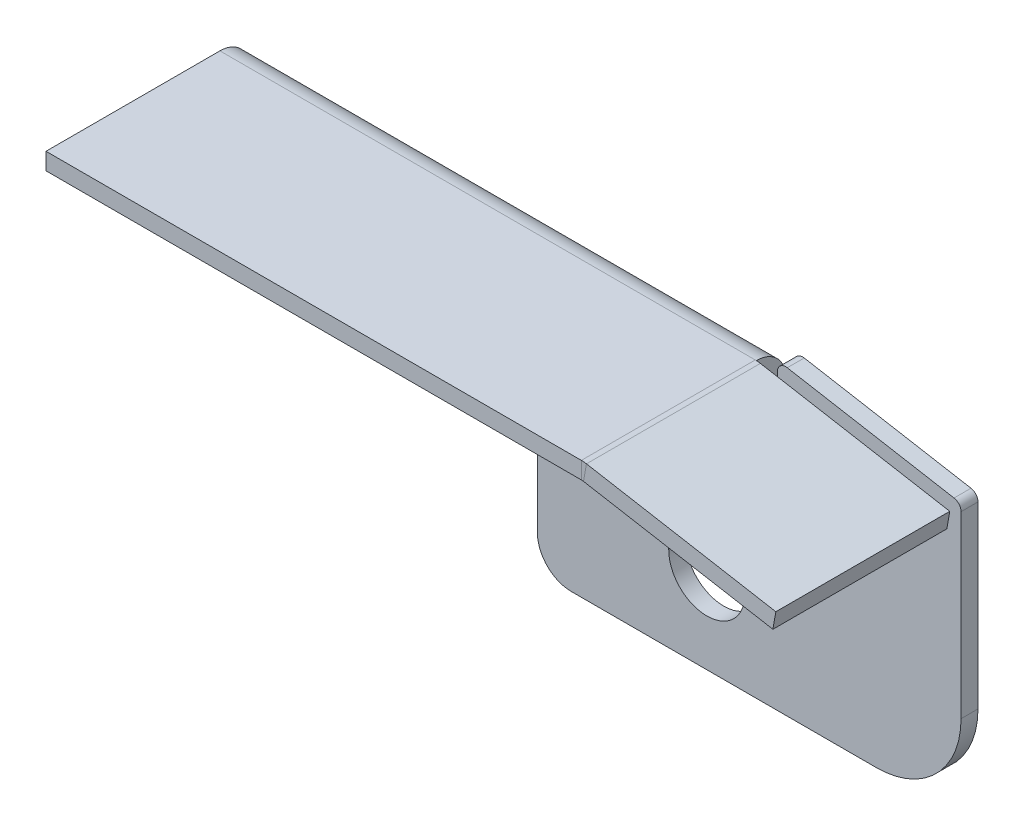
ISO-10303-21;
HEADER;
FILE_DESCRIPTION(('STEP AP214'),'2;1');
FILE_NAME('part.step','',(''),(''),'','','');
FILE_SCHEMA(('AUTOMOTIVE_DESIGN { 1 0 10303 214 1 1 1 1 }'));
ENDSEC;
DATA;
#1=APPLICATION_CONTEXT('core data for automotive mechanical design processes');
#2=APPLICATION_PROTOCOL_DEFINITION('international standard','automotive_design',2000,#1);
#3=PRODUCT_CONTEXT('',#1,'mechanical');
#4=PRODUCT('Part','Part','',(#3));
#5=PRODUCT_RELATED_PRODUCT_CATEGORY('part','',(#4));
#6=PRODUCT_DEFINITION_FORMATION('','',#4);
#7=PRODUCT_DEFINITION_CONTEXT('part definition',#1,'design');
#8=PRODUCT_DEFINITION('design','',#6,#7);
#9=PRODUCT_DEFINITION_SHAPE('','',#8);
#10=(LENGTH_UNIT() NAMED_UNIT(*) SI_UNIT(.MILLI.,.METRE.));
#11=(NAMED_UNIT(*) PLANE_ANGLE_UNIT() SI_UNIT($,.RADIAN.));
#12=(NAMED_UNIT(*) SI_UNIT($,.STERADIAN.) SOLID_ANGLE_UNIT());
#13=UNCERTAINTY_MEASURE_WITH_UNIT(LENGTH_MEASURE(1.E-05),#10,'distance_accuracy_value','');
#14=(GEOMETRIC_REPRESENTATION_CONTEXT(3) GLOBAL_UNCERTAINTY_ASSIGNED_CONTEXT((#13)) GLOBAL_UNIT_ASSIGNED_CONTEXT((#10,
#11,#12)) REPRESENTATION_CONTEXT('',''));
#15=CARTESIAN_POINT('',(0.,0.,0.));
#16=DIRECTION('',(0.,0.,1.));
#17=DIRECTION('',(1.,0.,0.));
#18=AXIS2_PLACEMENT_3D('',#15,#16,#17);
#19=CARTESIAN_POINT('',(0.,-0.50000000000001,0.));
#20=DIRECTION('',(0.,-1.,0.));
#21=DIRECTION('',(0.,0.,-1.));
#22=AXIS2_PLACEMENT_3D('',#19,#20,#21);
#23=PLANE('',#22);
#24=DIRECTION('',(0.,0.,1.));
#25=VECTOR('',#24,1.);
#26=CARTESIAN_POINT('',(-28.4070077887888,-0.499999999999933,12.));
#27=LINE('',#26,#25);
#28=CARTESIAN_POINT('',(-28.4070077887888,-0.499999999999933,12.));
#29=VERTEX_POINT('',#28);
#30=CARTESIAN_POINT('',(-28.4070077887888,-0.500000000000008,1.73659999999999));
#31=VERTEX_POINT('',#30);
#32=EDGE_CURVE('E260',#29,#31,#27,.F.);
#33=ORIENTED_EDGE('',*,*,#32,.T.);
#34=DIRECTION('',(-1.,0.,0.));
#35=VECTOR('',#34,1.);
#36=CARTESIAN_POINT('',(-28.3425636392357,-0.500000000000008,1.73659999999999));
#37=LINE('',#36,#35);
#38=CARTESIAN_POINT('',(-60.,-0.500000000000012,1.73659999999999));
#39=VERTEX_POINT('',#38);
#40=EDGE_CURVE('E398',#39,#31,#37,.F.);
#41=ORIENTED_EDGE('',*,*,#40,.F.);
#42=DIRECTION('',(0.,0.,1.));
#43=VECTOR('',#42,1.);
#44=CARTESIAN_POINT('',(-60.,-0.500000000000018,0.));
#45=LINE('',#44,#43);
#46=CARTESIAN_POINT('',(-60.,-0.499999999999976,12.));
#47=VERTEX_POINT('',#46);
#48=EDGE_CURVE('E688',#39,#47,#45,.T.);
#49=ORIENTED_EDGE('',*,*,#48,.T.);
#50=DIRECTION('',(1.,0.,0.));
#51=VECTOR('',#50,1.);
#52=CARTESIAN_POINT('',(0.,-0.499999999999969,12.));
#53=LINE('',#52,#51);
#54=EDGE_CURVE('E691',#47,#29,#53,.T.);
#55=ORIENTED_EDGE('',*,*,#54,.T.);
#56=EDGE_LOOP('',(#33,#41,#49,#55));
#57=FACE_BOUND('',#56,.T.);
#58=ADVANCED_FACE('F63',(#57),#23,.F.);
#59=CARTESIAN_POINT('',(0.,-1.50000000000001,0.));
#60=DIRECTION('',(0.,-1.,0.));
#61=DIRECTION('',(0.,0.,-1.));
#62=AXIS2_PLACEMENT_3D('',#59,#60,#61);
#63=PLANE('',#62);
#64=DIRECTION('',(-1.,0.,0.));
#65=VECTOR('',#64,1.);
#66=CARTESIAN_POINT('',(-28.3425636392357,-1.50000000000001,1.7366));
#67=LINE('',#66,#65);
#68=CARTESIAN_POINT('',(-28.4070077887888,-1.50000000000001,1.7366));
#69=VERTEX_POINT('',#68);
#70=CARTESIAN_POINT('',(-60.,-1.50000000000001,1.7366));
#71=VERTEX_POINT('',#70);
#72=EDGE_CURVE('E395',#69,#71,#67,.T.);
#73=ORIENTED_EDGE('',*,*,#72,.F.);
#74=DIRECTION('',(0.,0.,1.));
#75=VECTOR('',#74,1.);
#76=CARTESIAN_POINT('',(-28.4070077887888,-1.49999999999993,12.));
#77=LINE('',#76,#75);
#78=CARTESIAN_POINT('',(-28.4070077887888,-1.49999999999993,12.));
#79=VERTEX_POINT('',#78);
#80=EDGE_CURVE('E317',#79,#69,#77,.F.);
#81=ORIENTED_EDGE('',*,*,#80,.F.);
#82=DIRECTION('',(-1.,0.,0.));
#83=VECTOR('',#82,1.);
#84=CARTESIAN_POINT('',(-28.3425636392357,-1.49999999999997,12.));
#85=LINE('',#84,#83);
#86=CARTESIAN_POINT('',(-60.,-1.49999999999998,12.));
#87=VERTEX_POINT('',#86);
#88=EDGE_CURVE('E684',#87,#79,#85,.F.);
#89=ORIENTED_EDGE('',*,*,#88,.F.);
#90=DIRECTION('',(0.,0.,-1.));
#91=VECTOR('',#90,1.);
#92=CARTESIAN_POINT('',(-60.,-1.49999999999998,12.));
#93=LINE('',#92,#91);
#94=EDGE_CURVE('E402',#71,#87,#93,.F.);
#95=ORIENTED_EDGE('',*,*,#94,.F.);
#96=EDGE_LOOP('',(#73,#81,#89,#95));
#97=FACE_BOUND('',#96,.T.);
#98=ADVANCED_FACE('F352',(#97),#63,.T.);
#99=CARTESIAN_POINT('',(-28.3425636392357,-0.499999999999972,12.));
#100=DIRECTION('',(0.,0.,-1.));
#101=DIRECTION('',(0.,1.,0.));
#102=AXIS2_PLACEMENT_3D('',#99,#100,#101);
#103=PLANE('',#102);
#104=DIRECTION('',(0.,1.,0.));
#105=VECTOR('',#104,1.);
#106=CARTESIAN_POINT('',(-28.4070077887888,-1.49999999999993,12.));
#107=LINE('',#106,#105);
#108=EDGE_CURVE('E323',#79,#29,#107,.T.);
#109=ORIENTED_EDGE('',*,*,#108,.T.);
#110=ORIENTED_EDGE('',*,*,#54,.F.);
#111=DIRECTION('',(0.,-1.,0.));
#112=VECTOR('',#111,1.);
#113=CARTESIAN_POINT('',(-60.,-0.499999999999976,12.));
#114=LINE('',#113,#112);
#115=EDGE_CURVE('E663',#47,#87,#114,.T.);
#116=ORIENTED_EDGE('',*,*,#115,.T.);
#117=ORIENTED_EDGE('',*,*,#88,.T.);
#118=EDGE_LOOP('',(#109,#110,#116,#117));
#119=FACE_BOUND('',#118,.T.);
#120=ADVANCED_FACE('F356',(#119),#103,.F.);
#121=CARTESIAN_POINT('',(-22.,-13.5,1.));
#122=DIRECTION('',(0.,0.,-1.));
#123=DIRECTION('',(-1.,0.,0.));
#124=AXIS2_PLACEMENT_3D('',#121,#122,#123);
#125=PLANE('',#124);
#126=CARTESIAN_POINT('',(-32.,-7.50000000000001,1.));
#127=DIRECTION('',(0.,0.,1.));
#128=DIRECTION('',(1.,0.,0.));
#129=AXIS2_PLACEMENT_3D('',#126,#127,#128);
#130=CIRCLE('',#129,2.24999999999999);
#131=CARTESIAN_POINT('',(-29.75,-7.50000000000001,1.));
#132=VERTEX_POINT('',#131);
#133=CARTESIAN_POINT('',(-34.25,-7.50000000000001,1.));
#134=VERTEX_POINT('',#133);
#135=EDGE_CURVE('E534',#132,#134,#130,.T.);
#136=ORIENTED_EDGE('',*,*,#135,.F.);
#137=DIRECTION('',(0.,1.,0.));
#138=VECTOR('',#137,1.);
#139=CARTESIAN_POINT('',(-29.75,-7.50000000000001,1.));
#140=LINE('',#139,#138);
#141=CARTESIAN_POINT('',(-29.75,-13.5,1.));
#142=VERTEX_POINT('',#141);
#143=EDGE_CURVE('E545',#142,#132,#140,.T.);
#144=ORIENTED_EDGE('',*,*,#143,.F.);
#145=CARTESIAN_POINT('',(-32.,-13.5,1.));
#146=DIRECTION('',(0.,0.,1.));
#147=DIRECTION('',(1.,0.,0.));
#148=AXIS2_PLACEMENT_3D('',#145,#146,#147);
#149=CIRCLE('',#148,2.25);
#150=CARTESIAN_POINT('',(-34.25,-13.5,1.));
#151=VERTEX_POINT('',#150);
#152=EDGE_CURVE('E541',#151,#142,#149,.T.);
#153=ORIENTED_EDGE('',*,*,#152,.F.);
#154=DIRECTION('',(0.,-1.,0.));
#155=VECTOR('',#154,1.);
#156=CARTESIAN_POINT('',(-34.25,-7.50000000000001,1.));
#157=LINE('',#156,#155);
#158=EDGE_CURVE('E537',#134,#151,#157,.T.);
#159=ORIENTED_EDGE('',*,*,#158,.F.);
#160=EDGE_LOOP('',(#136,#144,#153,#159));
#161=FACE_BOUND('',#160,.T.);
#162=DIRECTION('',(0.,1.,0.));
#163=VECTOR('',#162,1.);
#164=CARTESIAN_POINT('',(-17.,-13.5,1.));
#165=LINE('',#164,#163);
#166=CARTESIAN_POINT('',(-17.,-13.5,1.));
#167=VERTEX_POINT('',#166);
#168=CARTESIAN_POINT('',(-17.,-2.91954981558865,1.));
#169=VERTEX_POINT('',#168);
#170=EDGE_CURVE('E438',#167,#169,#165,.T.);
#171=ORIENTED_EDGE('',*,*,#170,.T.);
#172=CARTESIAN_POINT('',(-17.5,-2.91954981558865,1.));
#173=DIRECTION('',(0.,0.,-1.));
#174=DIRECTION('',(-1.,0.,0.));
#175=AXIS2_PLACEMENT_3D('',#172,#173,#174);
#176=CIRCLE('',#175,0.5);
#177=CARTESIAN_POINT('',(-17.4131759111665,-2.42714593908255,1.));
#178=VERTEX_POINT('',#177);
#179=EDGE_CURVE('E72',#169,#178,#176,.F.);
#180=ORIENTED_EDGE('',*,*,#179,.T.);
#181=DIRECTION('',(-0.984807753012209,0.173648177666926,0.));
#182=VECTOR('',#181,1.);
#183=CARTESIAN_POINT('',(-17.,-2.50000000000001,1.));
#184=LINE('',#183,#182);
#185=CARTESIAN_POINT('',(-27.2557395504022,-0.69163641014524,1.));
#186=VERTEX_POINT('',#185);
#187=EDGE_CURVE('E437',#178,#186,#184,.T.);
#188=ORIENTED_EDGE('',*,*,#187,.T.);
#189=CARTESIAN_POINT('',(-27.3425636392356,-1.18404028665135,1.));
#190=DIRECTION('',(0.,0.,-1.));
#191=DIRECTION('',(-1.,0.,0.));
#192=AXIS2_PLACEMENT_3D('',#189,#190,#191);
#193=CIRCLE('',#192,0.5);
#194=CARTESIAN_POINT('',(-27.8425636392356,-1.18404028665135,0.999999999999999));
#195=VERTEX_POINT('',#194);
#196=EDGE_CURVE('E79',#186,#195,#193,.F.);
#197=ORIENTED_EDGE('',*,*,#196,.T.);
#198=DIRECTION('',(0.,1.,0.));
#199=VECTOR('',#198,1.);
#200=CARTESIAN_POINT('',(-27.8425636392356,-2.73660000000001,0.999999999999998));
#201=LINE('',#200,#199);
#202=CARTESIAN_POINT('',(-27.8425636392356,-2.73660000000001,1.));
#203=VERTEX_POINT('',#202);
#204=EDGE_CURVE('E522',#203,#195,#201,.T.);
#205=ORIENTED_EDGE('',*,*,#204,.F.);
#206=DIRECTION('',(1.,0.,0.));
#207=VECTOR('',#206,1.);
#208=CARTESIAN_POINT('',(-28.3425636392357,-2.73660000000001,0.999999999999998));
#209=LINE('',#208,#207);
#210=CARTESIAN_POINT('',(-28.3425636392357,-2.73660000000001,1.));
#211=VERTEX_POINT('',#210);
#212=EDGE_CURVE('E521',#211,#203,#209,.T.);
#213=ORIENTED_EDGE('',*,*,#212,.F.);
#214=DIRECTION('',(0.,-1.,0.));
#215=VECTOR('',#214,1.);
#216=CARTESIAN_POINT('',(-28.3425636392357,-2.23660000000001,0.999999999999998));
#217=LINE('',#216,#215);
#218=CARTESIAN_POINT('',(-28.3425636392357,-2.23660000000001,0.999999999999998));
#219=VERTEX_POINT('',#218);
#220=EDGE_CURVE('E519',#219,#211,#217,.T.);
#221=ORIENTED_EDGE('',*,*,#220,.F.);
#222=DIRECTION('',(-1.,0.,0.));
#223=VECTOR('',#222,1.);
#224=CARTESIAN_POINT('',(-60.,-2.23660000000001,0.999999999999998));
#225=LINE('',#224,#223);
#226=CARTESIAN_POINT('',(-60.,-2.23660000000001,0.999999999999998));
#227=VERTEX_POINT('',#226);
#228=EDGE_CURVE('E662',#227,#219,#225,.F.);
#229=ORIENTED_EDGE('',*,*,#228,.F.);
#230=DIRECTION('',(0.,-1.,0.));
#231=VECTOR('',#230,1.);
#232=CARTESIAN_POINT('',(-60.,-6.5,1.));
#233=LINE('',#232,#231);
#234=CARTESIAN_POINT('',(-60.,-6.50000000000001,1.));
#235=VERTEX_POINT('',#234);
#236=EDGE_CURVE('E464',#227,#235,#233,.T.);
#237=ORIENTED_EDGE('',*,*,#236,.T.);
#238=CARTESIAN_POINT('',(-58.,-6.50000000000001,1.));
#239=DIRECTION('',(0.,0.,1.));
#240=DIRECTION('',(-1.,0.,0.));
#241=AXIS2_PLACEMENT_3D('',#238,#239,#240);
#242=CIRCLE('',#241,2.);
#243=CARTESIAN_POINT('',(-58.,-8.50000000000001,1.));
#244=VERTEX_POINT('',#243);
#245=EDGE_CURVE('E579',#235,#244,#242,.T.);
#246=ORIENTED_EDGE('',*,*,#245,.T.);
#247=DIRECTION('',(1.,0.,0.));
#248=VECTOR('',#247,1.);
#249=CARTESIAN_POINT('',(-42.,-8.50000000000001,1.));
#250=LINE('',#249,#248);
#251=CARTESIAN_POINT('',(-42.,-8.50000000000001,1.));
#252=VERTEX_POINT('',#251);
#253=EDGE_CURVE('E582',#244,#252,#250,.T.);
#254=ORIENTED_EDGE('',*,*,#253,.T.);
#255=DIRECTION('',(0.,-1.,0.));
#256=VECTOR('',#255,1.);
#257=CARTESIAN_POINT('',(-42.,-8.50000000000001,1.));
#258=LINE('',#257,#256);
#259=CARTESIAN_POINT('',(-42.,-16.5,1.));
#260=VERTEX_POINT('',#259);
#261=EDGE_CURVE('E585',#252,#260,#258,.T.);
#262=ORIENTED_EDGE('',*,*,#261,.T.);
#263=CARTESIAN_POINT('',(-40.,-16.5,1.));
#264=DIRECTION('',(0.,0.,1.));
#265=DIRECTION('',(1.,0.,0.));
#266=AXIS2_PLACEMENT_3D('',#263,#264,#265);
#267=CIRCLE('',#266,2.);
#268=CARTESIAN_POINT('',(-40.,-18.5,1.));
#269=VERTEX_POINT('',#268);
#270=EDGE_CURVE('E588',#260,#269,#267,.T.);
#271=ORIENTED_EDGE('',*,*,#270,.T.);
#272=DIRECTION('',(1.,0.,0.));
#273=VECTOR('',#272,1.);
#274=CARTESIAN_POINT('',(-40.,-18.5,1.));
#275=LINE('',#274,#273);
#276=CARTESIAN_POINT('',(-22.,-18.5,1.));
#277=VERTEX_POINT('',#276);
#278=EDGE_CURVE('E591',#269,#277,#275,.T.);
#279=ORIENTED_EDGE('',*,*,#278,.T.);
#280=CARTESIAN_POINT('',(-22.,-13.5,1.));
#281=DIRECTION('',(0.,0.,1.));
#282=DIRECTION('',(-1.,0.,0.));
#283=AXIS2_PLACEMENT_3D('',#280,#281,#282);
#284=CIRCLE('',#283,5.);
#285=EDGE_CURVE('E594',#277,#167,#284,.T.);
#286=ORIENTED_EDGE('',*,*,#285,.T.);
#287=EDGE_LOOP('',(#171,#180,#188,#197,#205,#213,#221,#229,#237,#246,#254,#262,#271,#279,#286));
#288=FACE_BOUND('',#287,.T.);
#289=ADVANCED_FACE('F360',(#161,#288),#125,.F.);
#290=CARTESIAN_POINT('',(-22.,-13.5,0.));
#291=DIRECTION('',(0.,0.,-1.));
#292=DIRECTION('',(-1.,0.,0.));
#293=AXIS2_PLACEMENT_3D('',#290,#291,#292);
#294=PLANE('',#293);
#295=DIRECTION('',(0.,1.,0.));
#296=VECTOR('',#295,1.);
#297=CARTESIAN_POINT('',(-29.75,-7.50000000000001,0.));
#298=LINE('',#297,#296);
#299=CARTESIAN_POINT('',(-29.75,-13.5,0.));
#300=VERTEX_POINT('',#299);
#301=CARTESIAN_POINT('',(-29.75,-7.50000000000001,0.));
#302=VERTEX_POINT('',#301);
#303=EDGE_CURVE('E538',#300,#302,#298,.T.);
#304=ORIENTED_EDGE('',*,*,#303,.T.);
#305=CARTESIAN_POINT('',(-32.,-7.50000000000001,0.));
#306=DIRECTION('',(0.,0.,1.));
#307=DIRECTION('',(1.,0.,0.));
#308=AXIS2_PLACEMENT_3D('',#305,#306,#307);
#309=CIRCLE('',#308,2.24999999999999);
#310=CARTESIAN_POINT('',(-34.25,-7.50000000000001,0.));
#311=VERTEX_POINT('',#310);
#312=EDGE_CURVE('E533',#302,#311,#309,.T.);
#313=ORIENTED_EDGE('',*,*,#312,.T.);
#314=DIRECTION('',(0.,-1.,0.));
#315=VECTOR('',#314,1.);
#316=CARTESIAN_POINT('',(-34.25,-7.50000000000001,0.));
#317=LINE('',#316,#315);
#318=CARTESIAN_POINT('',(-34.25,-13.5,0.));
#319=VERTEX_POINT('',#318);
#320=EDGE_CURVE('E552',#311,#319,#317,.T.);
#321=ORIENTED_EDGE('',*,*,#320,.T.);
#322=CARTESIAN_POINT('',(-32.,-13.5,0.));
#323=DIRECTION('',(0.,0.,1.));
#324=DIRECTION('',(1.,0.,0.));
#325=AXIS2_PLACEMENT_3D('',#322,#323,#324);
#326=CIRCLE('',#325,2.25);
#327=EDGE_CURVE('E556',#319,#300,#326,.T.);
#328=ORIENTED_EDGE('',*,*,#327,.T.);
#329=EDGE_LOOP('',(#304,#313,#321,#328));
#330=FACE_BOUND('',#329,.T.);
#331=DIRECTION('',(-0.984807753012209,0.173648177666926,0.));
#332=VECTOR('',#331,1.);
#333=CARTESIAN_POINT('',(-17.,-2.50000000000001,0.));
#334=LINE('',#333,#332);
#335=CARTESIAN_POINT('',(-17.4131759111665,-2.42714593908255,0.));
#336=VERTEX_POINT('',#335);
#337=CARTESIAN_POINT('',(-27.2557395504022,-0.69163641014524,0.));
#338=VERTEX_POINT('',#337);
#339=EDGE_CURVE('E455',#336,#338,#334,.T.);
#340=ORIENTED_EDGE('',*,*,#339,.F.);
#341=CARTESIAN_POINT('',(-17.5,-2.91954981558865,0.));
#342=DIRECTION('',(0.,0.,-1.));
#343=DIRECTION('',(-1.,0.,0.));
#344=AXIS2_PLACEMENT_3D('',#341,#342,#343);
#345=CIRCLE('',#344,0.5);
#346=CARTESIAN_POINT('',(-17.,-2.91954981558865,0.));
#347=VERTEX_POINT('',#346);
#348=EDGE_CURVE('E428',#336,#347,#345,.T.);
#349=ORIENTED_EDGE('',*,*,#348,.T.);
#350=DIRECTION('',(0.,1.,0.));
#351=VECTOR('',#350,1.);
#352=CARTESIAN_POINT('',(-17.,-13.5,0.));
#353=LINE('',#352,#351);
#354=CARTESIAN_POINT('',(-17.,-13.5,0.));
#355=VERTEX_POINT('',#354);
#356=EDGE_CURVE('E454',#355,#347,#353,.T.);
#357=ORIENTED_EDGE('',*,*,#356,.F.);
#358=CARTESIAN_POINT('',(-22.,-13.5,0.));
#359=DIRECTION('',(0.,0.,1.));
#360=DIRECTION('',(-1.,0.,0.));
#361=AXIS2_PLACEMENT_3D('',#358,#359,#360);
#362=CIRCLE('',#361,5.);
#363=CARTESIAN_POINT('',(-22.,-18.5,0.));
#364=VERTEX_POINT('',#363);
#365=EDGE_CURVE('E460',#364,#355,#362,.T.);
#366=ORIENTED_EDGE('',*,*,#365,.F.);
#367=DIRECTION('',(1.,0.,0.));
#368=VECTOR('',#367,1.);
#369=CARTESIAN_POINT('',(-40.,-18.5,0.));
#370=LINE('',#369,#368);
#371=CARTESIAN_POINT('',(-40.,-18.5,0.));
#372=VERTEX_POINT('',#371);
#373=EDGE_CURVE('E466',#372,#364,#370,.T.);
#374=ORIENTED_EDGE('',*,*,#373,.F.);
#375=CARTESIAN_POINT('',(-40.,-16.5,0.));
#376=DIRECTION('',(0.,0.,1.));
#377=DIRECTION('',(1.,0.,0.));
#378=AXIS2_PLACEMENT_3D('',#375,#376,#377);
#379=CIRCLE('',#378,2.);
#380=CARTESIAN_POINT('',(-42.,-16.5,0.));
#381=VERTEX_POINT('',#380);
#382=EDGE_CURVE('E610',#381,#372,#379,.T.);
#383=ORIENTED_EDGE('',*,*,#382,.F.);
#384=DIRECTION('',(0.,-1.,0.));
#385=VECTOR('',#384,1.);
#386=CARTESIAN_POINT('',(-42.,-8.50000000000001,0.));
#387=LINE('',#386,#385);
#388=CARTESIAN_POINT('',(-42.,-8.50000000000001,0.));
#389=VERTEX_POINT('',#388);
#390=EDGE_CURVE('E607',#389,#381,#387,.T.);
#391=ORIENTED_EDGE('',*,*,#390,.F.);
#392=DIRECTION('',(1.,0.,0.));
#393=VECTOR('',#392,1.);
#394=CARTESIAN_POINT('',(-42.,-8.50000000000001,0.));
#395=LINE('',#394,#393);
#396=CARTESIAN_POINT('',(-58.,-8.50000000000001,0.));
#397=VERTEX_POINT('',#396);
#398=EDGE_CURVE('E604',#397,#389,#395,.T.);
#399=ORIENTED_EDGE('',*,*,#398,.F.);
#400=CARTESIAN_POINT('',(-58.,-6.50000000000001,0.));
#401=DIRECTION('',(0.,0.,1.));
#402=DIRECTION('',(-1.,0.,0.));
#403=AXIS2_PLACEMENT_3D('',#400,#401,#402);
#404=CIRCLE('',#403,2.);
#405=CARTESIAN_POINT('',(-60.,-6.50000000000001,0.));
#406=VERTEX_POINT('',#405);
#407=EDGE_CURVE('E601',#406,#397,#404,.T.);
#408=ORIENTED_EDGE('',*,*,#407,.F.);
#409=DIRECTION('',(0.,-1.,0.));
#410=VECTOR('',#409,1.);
#411=CARTESIAN_POINT('',(-60.,-6.5,0.));
#412=LINE('',#411,#410);
#413=CARTESIAN_POINT('',(-60.,-2.23660000000001,0.));
#414=VERTEX_POINT('',#413);
#415=EDGE_CURVE('E576',#414,#406,#412,.T.);
#416=ORIENTED_EDGE('',*,*,#415,.F.);
#417=DIRECTION('',(-1.,0.,0.));
#418=VECTOR('',#417,1.);
#419=CARTESIAN_POINT('',(-60.,-2.23660000000001,0.));
#420=LINE('',#419,#418);
#421=CARTESIAN_POINT('',(-28.3425636392357,-2.2366,0.));
#422=VERTEX_POINT('',#421);
#423=EDGE_CURVE('E390',#414,#422,#420,.F.);
#424=ORIENTED_EDGE('',*,*,#423,.T.);
#425=DIRECTION('',(0.,-1.,0.));
#426=VECTOR('',#425,1.);
#427=CARTESIAN_POINT('',(-28.3425636392357,-13.5,0.));
#428=LINE('',#427,#426);
#429=CARTESIAN_POINT('',(-28.3425636392357,-2.7366,0.));
#430=VERTEX_POINT('',#429);
#431=EDGE_CURVE('E421',#422,#430,#428,.T.);
#432=ORIENTED_EDGE('',*,*,#431,.T.);
#433=DIRECTION('',(1.,0.,0.));
#434=VECTOR('',#433,1.);
#435=CARTESIAN_POINT('',(-22.,-2.7366,0.));
#436=LINE('',#435,#434);
#437=CARTESIAN_POINT('',(-27.8425636392356,-2.73660000000001,0.));
#438=VERTEX_POINT('',#437);
#439=EDGE_CURVE('E496',#430,#438,#436,.T.);
#440=ORIENTED_EDGE('',*,*,#439,.T.);
#441=DIRECTION('',(0.,1.,0.));
#442=VECTOR('',#441,1.);
#443=CARTESIAN_POINT('',(-27.8425636392356,-13.5,0.));
#444=LINE('',#443,#442);
#445=CARTESIAN_POINT('',(-27.8425636392356,-1.18404028665135,0.));
#446=VERTEX_POINT('',#445);
#447=EDGE_CURVE('E530',#438,#446,#444,.T.);
#448=ORIENTED_EDGE('',*,*,#447,.T.);
#449=CARTESIAN_POINT('',(-27.3425636392356,-1.18404028665135,0.));
#450=DIRECTION('',(0.,0.,-1.));
#451=DIRECTION('',(-1.,0.,0.));
#452=AXIS2_PLACEMENT_3D('',#449,#450,#451);
#453=CIRCLE('',#452,0.5);
#454=EDGE_CURVE('E425',#446,#338,#453,.T.);
#455=ORIENTED_EDGE('',*,*,#454,.T.);
#456=EDGE_LOOP('',(#340,#349,#357,#366,#374,#383,#391,#399,#408,#416,#424,#432,#440,#448,#455));
#457=FACE_BOUND('',#456,.T.);
#458=ADVANCED_FACE('F452',(#330,#457),#294,.T.);
#459=CARTESIAN_POINT('',(-60.,-6.5,1.));
#460=DIRECTION('',(1.,0.,0.));
#461=DIRECTION('',(0.,1.,0.));
#462=AXIS2_PLACEMENT_3D('',#459,#460,#461);
#463=PLANE('',#462);
#464=DIRECTION('',(0.,0.,-1.));
#465=VECTOR('',#464,1.);
#466=CARTESIAN_POINT('',(-60.,-2.23660000000001,0.999999999999998));
#467=LINE('',#466,#465);
#468=EDGE_CURVE('E389',#227,#414,#467,.T.);
#469=ORIENTED_EDGE('',*,*,#468,.T.);
#470=ORIENTED_EDGE('',*,*,#415,.T.);
#471=DIRECTION('',(0.,0.,-1.));
#472=VECTOR('',#471,1.);
#473=CARTESIAN_POINT('',(-60.,-6.50000000000001,1.));
#474=LINE('',#473,#472);
#475=EDGE_CURVE('E492',#235,#406,#474,.T.);
#476=ORIENTED_EDGE('',*,*,#475,.F.);
#477=ORIENTED_EDGE('',*,*,#236,.F.);
#478=EDGE_LOOP('',(#469,#470,#476,#477));
#479=FACE_BOUND('',#478,.T.);
#480=ADVANCED_FACE('F644',(#479),#463,.F.);
#481=CARTESIAN_POINT('',(-17.,-2.50000000000001,1.));
#482=DIRECTION('',(-0.173648177666926,-0.984807753012209,0.));
#483=DIRECTION('',(0.984807753012209,-0.173648177666926,0.));
#484=AXIS2_PLACEMENT_3D('',#481,#482,#483);
#485=PLANE('',#484);
#486=ORIENTED_EDGE('',*,*,#187,.F.);
#487=DIRECTION('',(0.,0.,-1.));
#488=VECTOR('',#487,1.);
#489=CARTESIAN_POINT('',(-17.4131759111665,-2.42714593908255,1.));
#490=LINE('',#489,#488);
#491=EDGE_CURVE('E420',#178,#336,#490,.T.);
#492=ORIENTED_EDGE('',*,*,#491,.T.);
#493=ORIENTED_EDGE('',*,*,#339,.T.);
#494=DIRECTION('',(0.,0.,-1.));
#495=VECTOR('',#494,1.);
#496=CARTESIAN_POINT('',(-27.2557395504022,-0.69163641014524,1.));
#497=LINE('',#496,#495);
#498=EDGE_CURVE('E417',#338,#186,#497,.F.);
#499=ORIENTED_EDGE('',*,*,#498,.T.);
#500=EDGE_LOOP('',(#486,#492,#493,#499));
#501=FACE_BOUND('',#500,.T.);
#502=ADVANCED_FACE('F442',(#501),#485,.F.);
#503=CARTESIAN_POINT('',(-58.,-6.50000000000001,1.));
#504=DIRECTION('',(0.,0.,-1.));
#505=DIRECTION('',(-1.,0.,0.));
#506=AXIS2_PLACEMENT_3D('',#503,#504,#505);
#507=CYLINDRICAL_SURFACE('',#506,2.);
#508=ORIENTED_EDGE('',*,*,#407,.T.);
#509=DIRECTION('',(0.,0.,-1.));
#510=VECTOR('',#509,1.);
#511=CARTESIAN_POINT('',(-58.,-8.50000000000001,1.));
#512=LINE('',#511,#510);
#513=EDGE_CURVE('E488',#244,#397,#512,.T.);
#514=ORIENTED_EDGE('',*,*,#513,.F.);
#515=ORIENTED_EDGE('',*,*,#245,.F.);
#516=ORIENTED_EDGE('',*,*,#475,.T.);
#517=EDGE_LOOP('',(#508,#514,#515,#516));
#518=FACE_BOUND('',#517,.T.);
#519=ADVANCED_FACE('F640',(#518),#507,.T.);
#520=CARTESIAN_POINT('',(-42.,-8.50000000000001,1.));
#521=DIRECTION('',(0.,1.,0.));
#522=DIRECTION('',(-1.,0.,0.));
#523=AXIS2_PLACEMENT_3D('',#520,#521,#522);
#524=PLANE('',#523);
#525=ORIENTED_EDGE('',*,*,#398,.T.);
#526=DIRECTION('',(0.,0.,-1.));
#527=VECTOR('',#526,1.);
#528=CARTESIAN_POINT('',(-42.,-8.50000000000001,1.));
#529=LINE('',#528,#527);
#530=EDGE_CURVE('E484',#252,#389,#529,.T.);
#531=ORIENTED_EDGE('',*,*,#530,.F.);
#532=ORIENTED_EDGE('',*,*,#253,.F.);
#533=ORIENTED_EDGE('',*,*,#513,.T.);
#534=EDGE_LOOP('',(#525,#531,#532,#533));
#535=FACE_BOUND('',#534,.T.);
#536=ADVANCED_FACE('F636',(#535),#524,.F.);
#537=CARTESIAN_POINT('',(-42.,-8.50000000000001,1.));
#538=DIRECTION('',(1.,0.,0.));
#539=DIRECTION('',(0.,0.,-1.));
#540=AXIS2_PLACEMENT_3D('',#537,#538,#539);
#541=PLANE('',#540);
#542=ORIENTED_EDGE('',*,*,#390,.T.);
#543=DIRECTION('',(0.,0.,-1.));
#544=VECTOR('',#543,1.);
#545=CARTESIAN_POINT('',(-42.,-16.5,1.));
#546=LINE('',#545,#544);
#547=EDGE_CURVE('E480',#260,#381,#546,.T.);
#548=ORIENTED_EDGE('',*,*,#547,.F.);
#549=ORIENTED_EDGE('',*,*,#261,.F.);
#550=ORIENTED_EDGE('',*,*,#530,.T.);
#551=EDGE_LOOP('',(#542,#548,#549,#550));
#552=FACE_BOUND('',#551,.T.);
#553=ADVANCED_FACE('F632',(#552),#541,.F.);
#554=CARTESIAN_POINT('',(-40.,-16.5,1.));
#555=DIRECTION('',(0.,0.,-1.));
#556=DIRECTION('',(-1.,0.,0.));
#557=AXIS2_PLACEMENT_3D('',#554,#555,#556);
#558=CYLINDRICAL_SURFACE('',#557,2.);
#559=ORIENTED_EDGE('',*,*,#382,.T.);
#560=DIRECTION('',(0.,0.,-1.));
#561=VECTOR('',#560,1.);
#562=CARTESIAN_POINT('',(-40.,-18.5,1.));
#563=LINE('',#562,#561);
#564=EDGE_CURVE('E476',#269,#372,#563,.T.);
#565=ORIENTED_EDGE('',*,*,#564,.F.);
#566=ORIENTED_EDGE('',*,*,#270,.F.);
#567=ORIENTED_EDGE('',*,*,#547,.T.);
#568=EDGE_LOOP('',(#559,#565,#566,#567));
#569=FACE_BOUND('',#568,.T.);
#570=ADVANCED_FACE('F627',(#569),#558,.T.);
#571=CARTESIAN_POINT('',(-40.,-18.5,1.));
#572=DIRECTION('',(0.,1.,0.));
#573=DIRECTION('',(0.,0.,1.));
#574=AXIS2_PLACEMENT_3D('',#571,#572,#573);
#575=PLANE('',#574);
#576=ORIENTED_EDGE('',*,*,#373,.T.);
#577=DIRECTION('',(0.,0.,-1.));
#578=VECTOR('',#577,1.);
#579=CARTESIAN_POINT('',(-22.,-18.5,1.));
#580=LINE('',#579,#578);
#581=EDGE_CURVE('E472',#277,#364,#580,.T.);
#582=ORIENTED_EDGE('',*,*,#581,.F.);
#583=ORIENTED_EDGE('',*,*,#278,.F.);
#584=ORIENTED_EDGE('',*,*,#564,.T.);
#585=EDGE_LOOP('',(#576,#582,#583,#584));
#586=FACE_BOUND('',#585,.T.);
#587=ADVANCED_FACE('F616',(#586),#575,.F.);
#588=CARTESIAN_POINT('',(-22.,-13.5,1.));
#589=DIRECTION('',(0.,0.,-1.));
#590=DIRECTION('',(-1.,0.,0.));
#591=AXIS2_PLACEMENT_3D('',#588,#589,#590);
#592=CYLINDRICAL_SURFACE('',#591,5.);
#593=ORIENTED_EDGE('',*,*,#365,.T.);
#594=DIRECTION('',(0.,0.,-1.));
#595=VECTOR('',#594,1.);
#596=CARTESIAN_POINT('',(-17.,-13.5,1.));
#597=LINE('',#596,#595);
#598=EDGE_CURVE('E447',#167,#355,#597,.T.);
#599=ORIENTED_EDGE('',*,*,#598,.F.);
#600=ORIENTED_EDGE('',*,*,#285,.F.);
#601=ORIENTED_EDGE('',*,*,#581,.T.);
#602=EDGE_LOOP('',(#593,#599,#600,#601));
#603=FACE_BOUND('',#602,.T.);
#604=ADVANCED_FACE('F622',(#603),#592,.T.);
#605=CARTESIAN_POINT('',(-17.,-13.5,1.));
#606=DIRECTION('',(-1.,0.,0.));
#607=DIRECTION('',(0.,-1.,0.));
#608=AXIS2_PLACEMENT_3D('',#605,#606,#607);
#609=PLANE('',#608);
#610=ORIENTED_EDGE('',*,*,#356,.T.);
#611=DIRECTION('',(0.,0.,-1.));
#612=VECTOR('',#611,1.);
#613=CARTESIAN_POINT('',(-17.,-2.91954981558865,1.));
#614=LINE('',#613,#612);
#615=EDGE_CURVE('E87',#347,#169,#614,.F.);
#616=ORIENTED_EDGE('',*,*,#615,.T.);
#617=ORIENTED_EDGE('',*,*,#170,.F.);
#618=ORIENTED_EDGE('',*,*,#598,.T.);
#619=EDGE_LOOP('',(#610,#616,#617,#618));
#620=FACE_BOUND('',#619,.T.);
#621=ADVANCED_FACE('F457',(#620),#609,.F.);
#622=CARTESIAN_POINT('',(-32.,-7.50000000000001,1.));
#623=DIRECTION('',(0.,0.,-1.));
#624=DIRECTION('',(-1.,0.,0.));
#625=AXIS2_PLACEMENT_3D('',#622,#623,#624);
#626=CYLINDRICAL_SURFACE('',#625,2.24999999999999);
#627=ORIENTED_EDGE('',*,*,#312,.F.);
#628=DIRECTION('',(0.,0.,-1.));
#629=VECTOR('',#628,1.);
#630=CARTESIAN_POINT('',(-29.75,-7.50000000000001,1.));
#631=LINE('',#630,#629);
#632=EDGE_CURVE('E548',#132,#302,#631,.T.);
#633=ORIENTED_EDGE('',*,*,#632,.F.);
#634=ORIENTED_EDGE('',*,*,#135,.T.);
#635=DIRECTION('',(0.,0.,-1.));
#636=VECTOR('',#635,1.);
#637=CARTESIAN_POINT('',(-34.25,-7.50000000000001,1.));
#638=LINE('',#637,#636);
#639=EDGE_CURVE('E572',#134,#311,#638,.T.);
#640=ORIENTED_EDGE('',*,*,#639,.T.);
#641=EDGE_LOOP('',(#627,#633,#634,#640));
#642=FACE_BOUND('',#641,.T.);
#643=ADVANCED_FACE('F965',(#642),#626,.F.);
#644=CARTESIAN_POINT('',(-34.25,-7.50000000000001,1.));
#645=DIRECTION('',(1.,0.,0.));
#646=DIRECTION('',(0.,0.,-1.));
#647=AXIS2_PLACEMENT_3D('',#644,#645,#646);
#648=PLANE('',#647);
#649=ORIENTED_EDGE('',*,*,#320,.F.);
#650=ORIENTED_EDGE('',*,*,#639,.F.);
#651=ORIENTED_EDGE('',*,*,#158,.T.);
#652=DIRECTION('',(0.,0.,-1.));
#653=VECTOR('',#652,1.);
#654=CARTESIAN_POINT('',(-34.25,-13.5,1.));
#655=LINE('',#654,#653);
#656=EDGE_CURVE('E569',#151,#319,#655,.T.);
#657=ORIENTED_EDGE('',*,*,#656,.T.);
#658=EDGE_LOOP('',(#649,#650,#651,#657));
#659=FACE_BOUND('',#658,.T.);
#660=ADVANCED_FACE('F954',(#659),#648,.T.);
#661=CARTESIAN_POINT('',(-32.,-13.5,1.));
#662=DIRECTION('',(0.,0.,-1.));
#663=DIRECTION('',(-1.,0.,0.));
#664=AXIS2_PLACEMENT_3D('',#661,#662,#663);
#665=CYLINDRICAL_SURFACE('',#664,2.25);
#666=ORIENTED_EDGE('',*,*,#327,.F.);
#667=ORIENTED_EDGE('',*,*,#656,.F.);
#668=ORIENTED_EDGE('',*,*,#152,.T.);
#669=DIRECTION('',(0.,0.,-1.));
#670=VECTOR('',#669,1.);
#671=CARTESIAN_POINT('',(-29.75,-13.5,1.));
#672=LINE('',#671,#670);
#673=EDGE_CURVE('E566',#142,#300,#672,.T.);
#674=ORIENTED_EDGE('',*,*,#673,.T.);
#675=EDGE_LOOP('',(#666,#667,#668,#674));
#676=FACE_BOUND('',#675,.T.);
#677=ADVANCED_FACE('F943',(#676),#665,.F.);
#678=CARTESIAN_POINT('',(-29.75,-7.50000000000001,1.));
#679=DIRECTION('',(-1.,0.,0.));
#680=DIRECTION('',(0.,-1.,0.));
#681=AXIS2_PLACEMENT_3D('',#678,#679,#680);
#682=PLANE('',#681);
#683=ORIENTED_EDGE('',*,*,#303,.F.);
#684=ORIENTED_EDGE('',*,*,#673,.F.);
#685=ORIENTED_EDGE('',*,*,#143,.T.);
#686=ORIENTED_EDGE('',*,*,#632,.T.);
#687=EDGE_LOOP('',(#683,#684,#685,#686));
#688=FACE_BOUND('',#687,.T.);
#689=ADVANCED_FACE('F901',(#688),#682,.T.);
#690=CARTESIAN_POINT('',(-28.3425636392357,-2.23660000000001,0.999999999999998));
#691=DIRECTION('',(1.,0.,0.));
#692=DIRECTION('',(0.,0.,-1.));
#693=AXIS2_PLACEMENT_3D('',#690,#691,#692);
#694=PLANE('',#693);
#695=ORIENTED_EDGE('',*,*,#431,.F.);
#696=DIRECTION('',(0.,0.,-1.));
#697=VECTOR('',#696,1.);
#698=CARTESIAN_POINT('',(-28.3425636392357,-2.23660000000001,0.999999999999998));
#699=LINE('',#698,#697);
#700=EDGE_CURVE('E651',#219,#422,#699,.T.);
#701=ORIENTED_EDGE('',*,*,#700,.F.);
#702=ORIENTED_EDGE('',*,*,#220,.T.);
#703=DIRECTION('',(0.,0.,-1.));
#704=VECTOR('',#703,1.);
#705=CARTESIAN_POINT('',(-28.3425636392357,-2.73660000000001,0.999999999999998));
#706=LINE('',#705,#704);
#707=EDGE_CURVE('E513',#211,#430,#706,.T.);
#708=ORIENTED_EDGE('',*,*,#707,.T.);
#709=EDGE_LOOP('',(#695,#701,#702,#708));
#710=FACE_BOUND('',#709,.T.);
#711=ADVANCED_FACE('F517',(#710),#694,.T.);
#712=CARTESIAN_POINT('',(-28.3425636392357,-2.73660000000001,0.999999999999998));
#713=DIRECTION('',(0.,1.,0.));
#714=DIRECTION('',(0.,0.,1.));
#715=AXIS2_PLACEMENT_3D('',#712,#713,#714);
#716=PLANE('',#715);
#717=ORIENTED_EDGE('',*,*,#439,.F.);
#718=ORIENTED_EDGE('',*,*,#707,.F.);
#719=ORIENTED_EDGE('',*,*,#212,.T.);
#720=DIRECTION('',(0.,0.,-1.));
#721=VECTOR('',#720,1.);
#722=CARTESIAN_POINT('',(-27.8425636392356,-2.73660000000001,0.999999999999998));
#723=LINE('',#722,#721);
#724=EDGE_CURVE('E516',#203,#438,#723,.T.);
#725=ORIENTED_EDGE('',*,*,#724,.T.);
#726=EDGE_LOOP('',(#717,#718,#719,#725));
#727=FACE_BOUND('',#726,.T.);
#728=ADVANCED_FACE('F511',(#727),#716,.T.);
#729=CARTESIAN_POINT('',(-27.8425636392356,-2.73660000000001,0.999999999999998));
#730=DIRECTION('',(-1.,0.,0.));
#731=DIRECTION('',(0.,0.,1.));
#732=AXIS2_PLACEMENT_3D('',#729,#730,#731);
#733=PLANE('',#732);
#734=ORIENTED_EDGE('',*,*,#204,.T.);
#735=DIRECTION('',(0.,0.,-1.));
#736=VECTOR('',#735,1.);
#737=CARTESIAN_POINT('',(-27.8425636392356,-1.18404028665135,0.));
#738=LINE('',#737,#736);
#739=EDGE_CURVE('E13',#195,#446,#738,.T.);
#740=ORIENTED_EDGE('',*,*,#739,.T.);
#741=ORIENTED_EDGE('',*,*,#447,.F.);
#742=ORIENTED_EDGE('',*,*,#724,.F.);
#743=EDGE_LOOP('',(#734,#740,#741,#742));
#744=FACE_BOUND('',#743,.T.);
#745=ADVANCED_FACE('F872',(#744),#733,.T.);
#746=CARTESIAN_POINT('',(-28.3425636392357,-2.23660000000001,1.7366));
#747=DIRECTION('',(1.,0.,0.));
#748=DIRECTION('',(0.,0.,-1.));
#749=AXIS2_PLACEMENT_3D('',#746,#747,#748);
#750=PLANE('',#749);
#751=DIRECTION('',(0.,-1.,0.));
#752=VECTOR('',#751,1.);
#753=CARTESIAN_POINT('',(-28.3425636392357,-0.500000000000008,1.73659999999999));
#754=LINE('',#753,#752);
#755=CARTESIAN_POINT('',(-28.3425636392357,-1.50000000000001,1.7366));
#756=VERTEX_POINT('',#755);
#757=CARTESIAN_POINT('',(-28.3425749123748,-0.500608662403031,1.73659999999999));
#758=VERTEX_POINT('',#757);
#759=EDGE_CURVE('E326',#756,#758,#754,.F.);
#760=ORIENTED_EDGE('',*,*,#759,.F.);
#761=CARTESIAN_POINT('',(-28.3425636392357,-2.23660000000001,1.7366));
#762=DIRECTION('',(-1.,0.,0.));
#763=DIRECTION('',(0.,0.,1.));
#764=AXIS2_PLACEMENT_3D('',#761,#762,#763);
#765=CIRCLE('',#764,0.736600000000002);
#766=EDGE_CURVE('E666',#219,#756,#765,.F.);
#767=ORIENTED_EDGE('',*,*,#766,.F.);
#768=ORIENTED_EDGE('',*,*,#700,.T.);
#769=CARTESIAN_POINT('',(-28.3425636392357,-2.23660000000001,1.7366));
#770=DIRECTION('',(-1.,0.,0.));
#771=DIRECTION('',(0.,0.,1.));
#772=AXIS2_PLACEMENT_3D('',#769,#770,#771);
#773=CIRCLE('',#772,1.7366);
#774=EDGE_CURVE('E380',#422,#758,#773,.F.);
#775=ORIENTED_EDGE('',*,*,#774,.T.);
#776=EDGE_LOOP('',(#760,#767,#768,#775));
#777=FACE_BOUND('',#776,.T.);
#778=ADVANCED_FACE('F862',(#777),#750,.T.);
#779=CARTESIAN_POINT('',(-60.,-2.23660000000001,1.7366));
#780=DIRECTION('',(1.,0.,0.));
#781=DIRECTION('',(0.,0.,-1.));
#782=AXIS2_PLACEMENT_3D('',#779,#780,#781);
#783=PLANE('',#782);
#784=CARTESIAN_POINT('',(-60.,-2.23660000000001,1.7366));
#785=DIRECTION('',(-1.,0.,0.));
#786=DIRECTION('',(0.,0.,1.));
#787=AXIS2_PLACEMENT_3D('',#784,#785,#786);
#788=CIRCLE('',#787,0.736600000000002);
#789=EDGE_CURVE('E659',#71,#227,#788,.T.);
#790=ORIENTED_EDGE('',*,*,#789,.F.);
#791=DIRECTION('',(0.,-1.,0.));
#792=VECTOR('',#791,1.);
#793=CARTESIAN_POINT('',(-60.,-1.50000000000001,1.7366));
#794=LINE('',#793,#792);
#795=EDGE_CURVE('E403',#71,#39,#794,.F.);
#796=ORIENTED_EDGE('',*,*,#795,.T.);
#797=CARTESIAN_POINT('',(-60.,-2.23660000000001,1.7366));
#798=DIRECTION('',(-1.,0.,0.));
#799=DIRECTION('',(0.,0.,1.));
#800=AXIS2_PLACEMENT_3D('',#797,#798,#799);
#801=CIRCLE('',#800,1.7366);
#802=EDGE_CURVE('E670',#39,#414,#801,.T.);
#803=ORIENTED_EDGE('',*,*,#802,.T.);
#804=ORIENTED_EDGE('',*,*,#468,.F.);
#805=EDGE_LOOP('',(#790,#796,#803,#804));
#806=FACE_BOUND('',#805,.T.);
#807=ADVANCED_FACE('F370',(#806),#783,.F.);
#808=CARTESIAN_POINT('',(-60.,-2.23660000000001,1.7366));
#809=DIRECTION('',(-1.,0.,0.));
#810=DIRECTION('',(0.,1.,0.));
#811=AXIS2_PLACEMENT_3D('',#808,#809,#810);
#812=CYLINDRICAL_SURFACE('',#811,1.7366);
#813=ORIENTED_EDGE('',*,*,#423,.F.);
#814=ORIENTED_EDGE('',*,*,#802,.F.);
#815=ORIENTED_EDGE('',*,*,#40,.T.);
#816=CARTESIAN_POINT('',(-28.4070077887888,-0.500000000000008,1.73659999999999));
#817=DIRECTION('',(1.,0.,0.));
#818=VECTOR('',#817,1.);
#819=LINE('',#816,#818);
#820=EDGE_CURVE('E327',#31,#758,#819,.T.);
#821=ORIENTED_EDGE('',*,*,#820,.T.);
#822=ORIENTED_EDGE('',*,*,#774,.F.);
#823=EDGE_LOOP('',(#813,#814,#815,#821,#822));
#824=FACE_BOUND('',#823,.T.);
#825=ADVANCED_FACE('F366',(#824),#812,.T.);
#826=CARTESIAN_POINT('',(-60.,-2.23660000000001,1.7366));
#827=DIRECTION('',(-1.,0.,0.));
#828=DIRECTION('',(0.,1.,0.));
#829=AXIS2_PLACEMENT_3D('',#826,#827,#828);
#830=CYLINDRICAL_SURFACE('',#829,0.736600000000002);
#831=ORIENTED_EDGE('',*,*,#228,.T.);
#832=ORIENTED_EDGE('',*,*,#766,.T.);
#833=EDGE_CURVE('E675',#756,#69,#67,.T.);
#834=ORIENTED_EDGE('',*,*,#833,.T.);
#835=ORIENTED_EDGE('',*,*,#72,.T.);
#836=ORIENTED_EDGE('',*,*,#789,.T.);
#837=EDGE_LOOP('',(#831,#832,#834,#835,#836));
#838=FACE_BOUND('',#837,.T.);
#839=ADVANCED_FACE('F364',(#838),#830,.F.);
#840=CARTESIAN_POINT('',(-60.,-0.499999999999976,12.));
#841=DIRECTION('',(1.,0.,0.));
#842=DIRECTION('',(0.,1.,0.));
#843=AXIS2_PLACEMENT_3D('',#840,#841,#842);
#844=PLANE('',#843);
#845=ORIENTED_EDGE('',*,*,#795,.F.);
#846=ORIENTED_EDGE('',*,*,#94,.T.);
#847=ORIENTED_EDGE('',*,*,#115,.F.);
#848=ORIENTED_EDGE('',*,*,#48,.F.);
#849=EDGE_LOOP('',(#845,#846,#847,#848));
#850=FACE_BOUND('',#849,.T.);
#851=ADVANCED_FACE('F344',(#850),#844,.F.);
#852=CARTESIAN_POINT('',(-28.4070077887888,-2.23660000000003,1.7366));
#853=DIRECTION('',(0.,0.,-1.));
#854=DIRECTION('',(0.,1.,0.));
#855=AXIS2_PLACEMENT_3D('',#852,#853,#854);
#856=PLANE('',#855);
#857=ORIENTED_EDGE('',*,*,#833,.F.);
#858=ORIENTED_EDGE('',*,*,#759,.T.);
#859=CARTESIAN_POINT('',(-28.4070077887888,-0.500000000000009,1.73659999999999));
#860=CARTESIAN_POINT('',(-28.2550749757097,-0.500000000000009,1.73659999999999));
#861=CARTESIAN_POINT('',(-28.1054503634525,-0.526382856119007,1.73659999999999));
#862=B_SPLINE_CURVE_WITH_KNOTS('',2,(#859,#860,#861),.UNSPECIFIED.,.F.,.F.,(3,3),(0.,1.),.UNSPECIFIED.);
#863=CARTESIAN_POINT('',(-28.1054503634525,-0.526382856119006,1.73659999999999));
#864=VERTEX_POINT('',#863);
#865=EDGE_CURVE('E698',#758,#864,#862,.T.);
#866=ORIENTED_EDGE('',*,*,#865,.T.);
#867=DIRECTION('',(0.173648177666924,0.984807753012209,0.));
#868=VECTOR('',#867,1.);
#869=CARTESIAN_POINT('',(-28.2790985411194,-1.51119060913122,1.7366));
#870=LINE('',#869,#868);
#871=CARTESIAN_POINT('',(-28.2790985411194,-1.51119060913122,1.7366));
#872=VERTEX_POINT('',#871);
#873=EDGE_CURVE('E408',#872,#864,#870,.T.);
#874=ORIENTED_EDGE('',*,*,#873,.F.);
#875=CARTESIAN_POINT('',(-28.4070077887888,-2.23660000000003,1.7366));
#876=DIRECTION('',(0.,0.,1.));
#877=DIRECTION('',(0.,-1.,0.));
#878=AXIS2_PLACEMENT_3D('',#875,#876,#877);
#879=CIRCLE('',#878,0.736600000000024);
#880=EDGE_CURVE('E264',#69,#872,#879,.F.);
#881=ORIENTED_EDGE('',*,*,#880,.F.);
#882=EDGE_LOOP('',(#857,#858,#866,#874,#881));
#883=FACE_BOUND('',#882,.T.);
#884=ADVANCED_FACE('F334',(#883),#856,.T.);
#885=CARTESIAN_POINT('',(-28.4070077887888,-2.23659999999996,12.));
#886=DIRECTION('',(0.,0.,-1.));
#887=DIRECTION('',(0.,1.,0.));
#888=AXIS2_PLACEMENT_3D('',#885,#886,#887);
#889=PLANE('',#888);
#890=CARTESIAN_POINT('',(-28.4070077887888,-2.23659999999996,12.));
#891=DIRECTION('',(0.,0.,1.));
#892=DIRECTION('',(0.,-1.,0.));
#893=AXIS2_PLACEMENT_3D('',#890,#891,#892);
#894=CIRCLE('',#893,0.736600000000024);
#895=CARTESIAN_POINT('',(-28.2790985411194,-1.51119060913114,12.));
#896=VERTEX_POINT('',#895);
#897=EDGE_CURVE('E271',#896,#79,#894,.T.);
#898=ORIENTED_EDGE('',*,*,#897,.F.);
#899=DIRECTION('',(0.173648177666924,0.984807753012209,0.));
#900=VECTOR('',#899,1.);
#901=CARTESIAN_POINT('',(-28.2790985411194,-1.51119060913118,12.));
#902=LINE('',#901,#900);
#903=CARTESIAN_POINT('',(-28.1054503634525,-0.526382856118989,12.));
#904=VERTEX_POINT('',#903);
#905=EDGE_CURVE('E268',#896,#904,#902,.T.);
#906=ORIENTED_EDGE('',*,*,#905,.T.);
#907=CARTESIAN_POINT('',(-28.4070077887888,-2.23659999999996,12.));
#908=DIRECTION('',(0.,0.,1.));
#909=DIRECTION('',(0.,-1.,0.));
#910=AXIS2_PLACEMENT_3D('',#907,#908,#909);
#911=CIRCLE('',#910,1.73660000000002);
#912=EDGE_CURVE('E252',#904,#29,#911,.T.);
#913=ORIENTED_EDGE('',*,*,#912,.T.);
#914=ORIENTED_EDGE('',*,*,#108,.F.);
#915=EDGE_LOOP('',(#898,#906,#913,#914));
#916=FACE_BOUND('',#915,.T.);
#917=ADVANCED_FACE('F269',(#916),#889,.F.);
#918=CARTESIAN_POINT('',(-28.4070077887888,-2.23659999999996,12.));
#919=DIRECTION('',(0.,0.,1.));
#920=DIRECTION('',(0.173648177666924,0.984807753012209,0.));
#921=AXIS2_PLACEMENT_3D('',#918,#919,#920);
#922=CYLINDRICAL_SURFACE('',#921,1.73660000000002);
#923=ORIENTED_EDGE('',*,*,#32,.F.);
#924=ORIENTED_EDGE('',*,*,#912,.F.);
#925=DIRECTION('',(0.,0.,-1.));
#926=VECTOR('',#925,1.);
#927=CARTESIAN_POINT('',(-28.1054503634525,-0.526382856119015,0.));
#928=LINE('',#927,#926);
#929=EDGE_CURVE('E257',#904,#864,#928,.T.);
#930=ORIENTED_EDGE('',*,*,#929,.T.);
#931=ORIENTED_EDGE('',*,*,#865,.F.);
#932=ORIENTED_EDGE('',*,*,#820,.F.);
#933=EDGE_LOOP('',(#923,#924,#930,#931,#932));
#934=FACE_BOUND('',#933,.T.);
#935=ADVANCED_FACE('F254',(#934),#922,.T.);
#936=CARTESIAN_POINT('',(-28.4070077887888,-2.23659999999996,12.));
#937=DIRECTION('',(0.,0.,1.));
#938=DIRECTION('',(0.173648177666924,0.984807753012209,0.));
#939=AXIS2_PLACEMENT_3D('',#936,#937,#938);
#940=CYLINDRICAL_SURFACE('',#939,0.736600000000024);
#941=ORIENTED_EDGE('',*,*,#80,.T.);
#942=ORIENTED_EDGE('',*,*,#880,.T.);
#943=DIRECTION('',(0.,0.,1.));
#944=VECTOR('',#943,1.);
#945=CARTESIAN_POINT('',(-28.2790985411194,-1.51119060913122,1.7366));
#946=LINE('',#945,#944);
#947=EDGE_CURVE('E276',#872,#896,#946,.T.);
#948=ORIENTED_EDGE('',*,*,#947,.T.);
#949=ORIENTED_EDGE('',*,*,#897,.T.);
#950=EDGE_LOOP('',(#941,#942,#948,#949));
#951=FACE_BOUND('',#950,.T.);
#952=ADVANCED_FACE('F346',(#951),#940,.F.);
#953=CARTESIAN_POINT('',(-16.9297858160693,-2.49695404316959,12.));
#954=DIRECTION('',(0.,0.,-1.));
#955=DIRECTION('',(0.,1.,0.));
#956=AXIS2_PLACEMENT_3D('',#953,#954,#955);
#957=PLANE('',#956);
#958=ORIENTED_EDGE('',*,*,#905,.F.);
#959=DIRECTION('',(0.984807753012209,-0.173648177666924,0.));
#960=VECTOR('',#959,1.);
#961=CARTESIAN_POINT('',(-17.1034339937363,-3.4817617961818,12.));
#962=LINE('',#961,#960);
#963=CARTESIAN_POINT('',(-17.1034339937363,-3.4817617961818,12.));
#964=VERTEX_POINT('',#963);
#965=EDGE_CURVE('E286',#896,#964,#962,.T.);
#966=ORIENTED_EDGE('',*,*,#965,.T.);
#967=DIRECTION('',(-0.173648177666924,-0.984807753012209,0.));
#968=VECTOR('',#967,1.);
#969=CARTESIAN_POINT('',(-16.9297858160693,-2.49695404316959,12.));
#970=LINE('',#969,#968);
#971=CARTESIAN_POINT('',(-16.9297858160693,-2.49695404316959,12.));
#972=VERTEX_POINT('',#971);
#973=EDGE_CURVE('E290',#972,#964,#970,.T.);
#974=ORIENTED_EDGE('',*,*,#973,.F.);
#975=DIRECTION('',(0.984807753012209,-0.173648177666924,0.));
#976=VECTOR('',#975,1.);
#977=CARTESIAN_POINT('',(-16.9297858160693,-2.49695404316959,12.));
#978=LINE('',#977,#976);
#979=EDGE_CURVE('E281',#904,#972,#978,.T.);
#980=ORIENTED_EDGE('',*,*,#979,.F.);
#981=EDGE_LOOP('',(#958,#966,#974,#980));
#982=FACE_BOUND('',#981,.T.);
#983=ADVANCED_FACE('F288',(#982),#957,.F.);
#984=CARTESIAN_POINT('',(-28.1689154615687,-0.515192246987799,1.73659999999999));
#985=DIRECTION('',(0.,0.,1.));
#986=DIRECTION('',(0.,-1.,0.));
#987=AXIS2_PLACEMENT_3D('',#984,#985,#986);
#988=PLANE('',#987);
#989=ORIENTED_EDGE('',*,*,#873,.T.);
#990=DIRECTION('',(-0.984807753012209,0.173648177666924,0.));
#991=VECTOR('',#990,1.);
#992=CARTESIAN_POINT('',(-28.1689154615687,-0.515192246987799,1.73659999999999));
#993=LINE('',#992,#991);
#994=CARTESIAN_POINT('',(-16.9297858160693,-2.49695404316963,1.7366));
#995=VERTEX_POINT('',#994);
#996=EDGE_CURVE('E284',#995,#864,#993,.T.);
#997=ORIENTED_EDGE('',*,*,#996,.F.);
#998=DIRECTION('',(-0.173648177666924,-0.984807753012209,0.));
#999=VECTOR('',#998,1.);
#1000=CARTESIAN_POINT('',(-16.9297858160693,-2.49695404316963,1.7366));
#1001=LINE('',#1000,#999);
#1002=CARTESIAN_POINT('',(-17.1034339937362,-3.48176179618184,1.7366));
#1003=VERTEX_POINT('',#1002);
#1004=EDGE_CURVE('E308',#995,#1003,#1001,.T.);
#1005=ORIENTED_EDGE('',*,*,#1004,.T.);
#1006=DIRECTION('',(-0.984807753012209,0.173648177666924,0.));
#1007=VECTOR('',#1006,1.);
#1008=CARTESIAN_POINT('',(-28.3425636392357,-1.50000000000001,1.7366));
#1009=LINE('',#1008,#1007);
#1010=EDGE_CURVE('E294',#1003,#872,#1009,.T.);
#1011=ORIENTED_EDGE('',*,*,#1010,.T.);
#1012=EDGE_LOOP('',(#989,#997,#1005,#1011));
#1013=FACE_BOUND('',#1012,.T.);
#1014=ADVANCED_FACE('F714',(#1013),#988,.F.);
#1015=CARTESIAN_POINT('',(-0.937499796472709,-5.31682555163119,0.));
#1016=DIRECTION('',(-0.173648177666924,-0.984807753012209,0.));
#1017=DIRECTION('',(0.984807753012209,-0.173648177666924,0.));
#1018=AXIS2_PLACEMENT_3D('',#1015,#1016,#1017);
#1019=PLANE('',#1018);
#1020=ORIENTED_EDGE('',*,*,#929,.F.);
#1021=ORIENTED_EDGE('',*,*,#979,.T.);
#1022=DIRECTION('',(0.,0.,-1.));
#1023=VECTOR('',#1022,1.);
#1024=CARTESIAN_POINT('',(-16.9297858160693,-2.49695404316963,1.7366));
#1025=LINE('',#1024,#1023);
#1026=EDGE_CURVE('E293',#972,#995,#1025,.T.);
#1027=ORIENTED_EDGE('',*,*,#1026,.T.);
#1028=ORIENTED_EDGE('',*,*,#996,.T.);
#1029=EDGE_LOOP('',(#1020,#1021,#1027,#1028));
#1030=FACE_BOUND('',#1029,.T.);
#1031=ADVANCED_FACE('F280',(#1030),#1019,.F.);
#1032=CARTESIAN_POINT('',(-1.11114797413963,-6.3016333046434,0.));
#1033=DIRECTION('',(-0.173648177666924,-0.984807753012209,0.));
#1034=DIRECTION('',(0.984807753012209,-0.173648177666924,0.));
#1035=AXIS2_PLACEMENT_3D('',#1032,#1033,#1034);
#1036=PLANE('',#1035);
#1037=ORIENTED_EDGE('',*,*,#965,.F.);
#1038=ORIENTED_EDGE('',*,*,#947,.F.);
#1039=ORIENTED_EDGE('',*,*,#1010,.F.);
#1040=DIRECTION('',(0.,0.,-1.));
#1041=VECTOR('',#1040,1.);
#1042=CARTESIAN_POINT('',(-17.1034339937362,-3.48176179618184,1.7366));
#1043=LINE('',#1042,#1041);
#1044=EDGE_CURVE('E300',#964,#1003,#1043,.T.);
#1045=ORIENTED_EDGE('',*,*,#1044,.F.);
#1046=EDGE_LOOP('',(#1037,#1038,#1039,#1045));
#1047=FACE_BOUND('',#1046,.T.);
#1048=ADVANCED_FACE('F718',(#1047),#1036,.T.);
#1049=CARTESIAN_POINT('',(-16.9297858160693,-2.49695404316963,1.7366));
#1050=DIRECTION('',(-0.984807753012209,0.173648177666924,0.));
#1051=DIRECTION('',(-0.173648177666924,-0.984807753012209,0.));
#1052=AXIS2_PLACEMENT_3D('',#1049,#1050,#1051);
#1053=PLANE('',#1052);
#1054=ORIENTED_EDGE('',*,*,#1044,.T.);
#1055=ORIENTED_EDGE('',*,*,#1004,.F.);
#1056=ORIENTED_EDGE('',*,*,#1026,.F.);
#1057=ORIENTED_EDGE('',*,*,#973,.T.);
#1058=EDGE_LOOP('',(#1054,#1055,#1056,#1057));
#1059=FACE_BOUND('',#1058,.T.);
#1060=ADVANCED_FACE('F715',(#1059),#1053,.F.);
#1061=CARTESIAN_POINT('',(-17.5,-2.91954981558865,1.));
#1062=DIRECTION('',(0.,0.,-1.));
#1063=DIRECTION('',(-1.,0.,0.));
#1064=AXIS2_PLACEMENT_3D('',#1061,#1062,#1063);
#1065=CYLINDRICAL_SURFACE('',#1064,0.5);
#1066=ORIENTED_EDGE('',*,*,#179,.F.);
#1067=ORIENTED_EDGE('',*,*,#615,.F.);
#1068=ORIENTED_EDGE('',*,*,#348,.F.);
#1069=ORIENTED_EDGE('',*,*,#491,.F.);
#1070=EDGE_LOOP('',(#1066,#1067,#1068,#1069));
#1071=FACE_BOUND('',#1070,.T.);
#1072=ADVANCED_FACE('F449',(#1071),#1065,.T.);
#1073=CARTESIAN_POINT('',(-27.3425636392356,-1.18404028665135,0.999999999999998));
#1074=DIRECTION('',(0.,0.,1.));
#1075=DIRECTION('',(1.,0.,0.));
#1076=AXIS2_PLACEMENT_3D('',#1073,#1074,#1075);
#1077=CYLINDRICAL_SURFACE('',#1076,0.5);
#1078=ORIENTED_EDGE('',*,*,#196,.F.);
#1079=ORIENTED_EDGE('',*,*,#498,.F.);
#1080=ORIENTED_EDGE('',*,*,#454,.F.);
#1081=ORIENTED_EDGE('',*,*,#739,.F.);
#1082=EDGE_LOOP('',(#1078,#1079,#1080,#1081));
#1083=FACE_BOUND('',#1082,.T.);
#1084=ADVANCED_FACE('F65',(#1083),#1077,.T.);
#1085=CLOSED_SHELL('',(#58,#98,#120,#289,#458,#480,#502,#519,#536,#553,#570,#587,#604,#621,#643,
#660,#677,#689,#711,#728,#745,#778,#807,#825,#839,#851,#884,#917,#935,#952,#983,#1014,#1031,
#1048,#1060,#1072,#1084));
#1086=MANIFOLD_SOLID_BREP('B2',#1085);
#1087=ADVANCED_BREP_SHAPE_REPRESENTATION('',(#18,#1086),#14);
#1088=SHAPE_DEFINITION_REPRESENTATION(#9,#1087);
ENDSEC;
END-ISO-10303-21;
